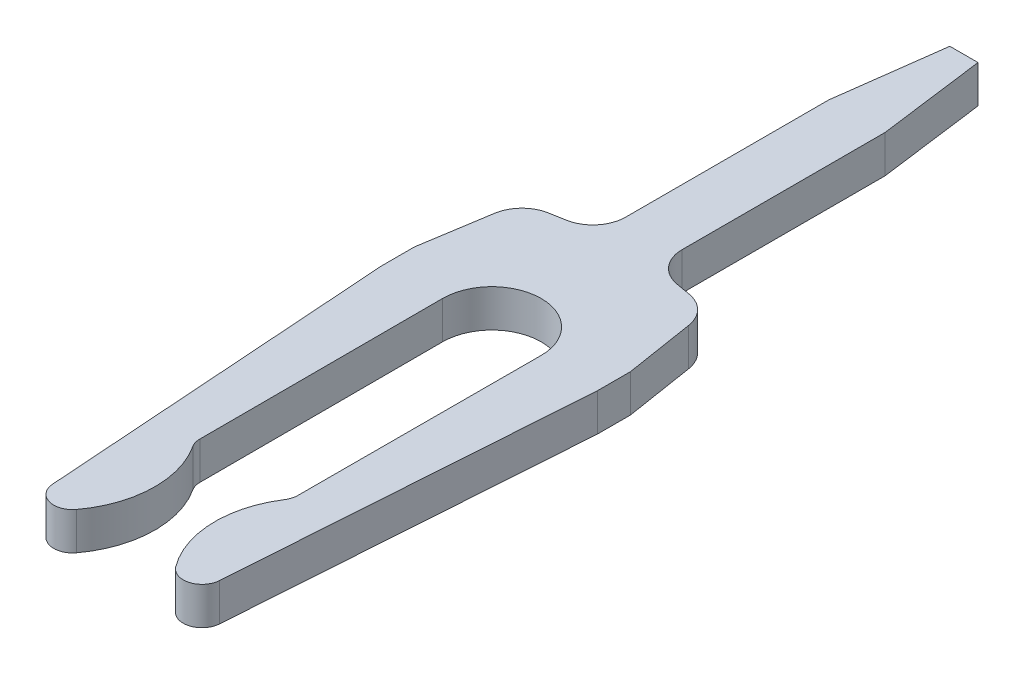
ISO-10303-21;
HEADER;
FILE_DESCRIPTION(('STEP AP214'),'2;1');
FILE_NAME('part.step','',(''),(''),'','','');
FILE_SCHEMA(('AUTOMOTIVE_DESIGN { 1 0 10303 214 1 1 1 1 }'));
ENDSEC;
DATA;
#1=APPLICATION_CONTEXT('core data for automotive mechanical design processes');
#2=APPLICATION_PROTOCOL_DEFINITION('international standard','automotive_design',2000,#1);
#3=PRODUCT_CONTEXT('',#1,'mechanical');
#4=PRODUCT('Part','Part','',(#3));
#5=PRODUCT_RELATED_PRODUCT_CATEGORY('part','',(#4));
#6=PRODUCT_DEFINITION_FORMATION('','',#4);
#7=PRODUCT_DEFINITION_CONTEXT('part definition',#1,'design');
#8=PRODUCT_DEFINITION('design','',#6,#7);
#9=PRODUCT_DEFINITION_SHAPE('','',#8);
#10=(LENGTH_UNIT() NAMED_UNIT(*) SI_UNIT(.MILLI.,.METRE.));
#11=(NAMED_UNIT(*) PLANE_ANGLE_UNIT() SI_UNIT($,.RADIAN.));
#12=(NAMED_UNIT(*) SI_UNIT($,.STERADIAN.) SOLID_ANGLE_UNIT());
#13=UNCERTAINTY_MEASURE_WITH_UNIT(LENGTH_MEASURE(1.E-05),#10,'distance_accuracy_value','');
#14=(GEOMETRIC_REPRESENTATION_CONTEXT(3) GLOBAL_UNCERTAINTY_ASSIGNED_CONTEXT((#13)) GLOBAL_UNIT_ASSIGNED_CONTEXT((#10,
#11,#12)) REPRESENTATION_CONTEXT('',''));
#15=CARTESIAN_POINT('',(0.,0.,0.));
#16=DIRECTION('',(0.,0.,1.));
#17=DIRECTION('',(1.,0.,0.));
#18=AXIS2_PLACEMENT_3D('',#15,#16,#17);
#19=CARTESIAN_POINT('',(0.,-0.2,0.));
#20=DIRECTION('',(0.,1.,0.));
#21=DIRECTION('',(1.,0.,0.));
#22=AXIS2_PLACEMENT_3D('',#19,#20,#21);
#23=PLANE('',#22);
#24=CARTESIAN_POINT('',(0.689021038746,-0.2,5.8));
#25=DIRECTION('',(0.,1.,0.));
#26=DIRECTION('',(-0.80115171912508,0.,0.59846129611106));
#27=AXIS2_PLACEMENT_3D('',#24,#25,#26);
#28=CIRCLE('',#27,0.2);
#29=CARTESIAN_POINT('',(0.52879069492,-0.2,5.919692259222));
#30=VERTEX_POINT('',#29);
#31=CARTESIAN_POINT('',(0.888540227534,-0.2,5.813859772906));
#32=VERTEX_POINT('',#31);
#33=EDGE_CURVE('E25',#30,#32,#28,.T.);
#34=ORIENTED_EDGE('',*,*,#33,.F.);
#35=CARTESIAN_POINT('',(1.37,-0.2,5.291307898307));
#36=DIRECTION('',(0.,1.,0.));
#37=DIRECTION('',(-0.839240132274354,0.,-0.54376097725023));
#38=AXIS2_PLACEMENT_3D('',#35,#36,#37);
#39=CIRCLE('',#38,1.05);
#40=CARTESIAN_POINT('',(0.488797861112,-0.2,4.720358872194));
#41=VERTEX_POINT('',#40);
#42=EDGE_CURVE('E532',#41,#30,#39,.T.);
#43=ORIENTED_EDGE('',*,*,#42,.F.);
#44=CARTESIAN_POINT('',(0.32094983466,-0.2,4.611606676746));
#45=DIRECTION('',(0.,-1.,0.));
#46=DIRECTION('',(0.999998773861923,0.,0.00156597402594488));
#47=AXIS2_PLACEMENT_3D('',#44,#45,#46);
#48=CIRCLE('',#47,0.2);
#49=CARTESIAN_POINT('',(0.520949589432,-0.2,4.611919871551));
#50=VERTEX_POINT('',#49);
#51=EDGE_CURVE('E399',#50,#41,#48,.T.);
#52=ORIENTED_EDGE('',*,*,#51,.F.);
#53=DIRECTION('',(-0.00156597402468689,0.,0.999998773861925));
#54=VECTOR('',#53,1.);
#55=CARTESIAN_POINT('',(0.524999356276,-0.2,2.025822136364));
#56=LINE('',#55,#54);
#57=CARTESIAN_POINT('',(0.524999356276,-0.2,2.025822136364));
#58=VERTEX_POINT('',#57);
#59=EDGE_CURVE('E411',#58,#50,#56,.T.);
#60=ORIENTED_EDGE('',*,*,#59,.F.);
#61=CARTESIAN_POINT('',(0.,-0.2,2.025));
#62=DIRECTION('',(0.,-1.,0.));
#63=DIRECTION('',(-0.999998773861923,0.,0.00156597402585288));
#64=AXIS2_PLACEMENT_3D('',#61,#62,#63);
#65=CIRCLE('',#64,0.525);
#66=CARTESIAN_POINT('',(-0.524999356278,-0.2,2.025822136364));
#67=VERTEX_POINT('',#66);
#68=EDGE_CURVE('E513',#67,#58,#65,.T.);
#69=ORIENTED_EDGE('',*,*,#68,.F.);
#70=DIRECTION('',(-0.00156597402468489,0.,-0.999998773861925));
#71=VECTOR('',#70,1.);
#72=CARTESIAN_POINT('',(-0.520949589432,-0.2,4.611919871551));
#73=LINE('',#72,#71);
#74=CARTESIAN_POINT('',(-0.520949589432,-0.2,4.611919871551));
#75=VERTEX_POINT('',#74);
#76=EDGE_CURVE('E501',#75,#67,#73,.T.);
#77=ORIENTED_EDGE('',*,*,#76,.F.);
#78=CARTESIAN_POINT('',(-0.32094983466,-0.2,4.611606676746));
#79=DIRECTION('',(0.,-1.,0.));
#80=DIRECTION('',(-0.839240132274354,0.,0.54376097725023));
#81=AXIS2_PLACEMENT_3D('',#78,#79,#80);
#82=CIRCLE('',#81,0.2);
#83=CARTESIAN_POINT('',(-0.488797861115,-0.2,4.720358872196));
#84=VERTEX_POINT('',#83);
#85=EDGE_CURVE('E340',#84,#75,#82,.T.);
#86=ORIENTED_EDGE('',*,*,#85,.F.);
#87=CARTESIAN_POINT('',(-1.37,-0.2,5.291307898307));
#88=DIRECTION('',(0.,1.,0.));
#89=DIRECTION('',(0.80115171912508,0.,0.59846129611106));
#90=AXIS2_PLACEMENT_3D('',#87,#88,#89);
#91=CIRCLE('',#90,1.05);
#92=CARTESIAN_POINT('',(-0.528790694919,-0.2,5.919692259224));
#93=VERTEX_POINT('',#92);
#94=EDGE_CURVE('E472',#93,#84,#91,.T.);
#95=ORIENTED_EDGE('',*,*,#94,.F.);
#96=CARTESIAN_POINT('',(-0.689021038746,-0.2,5.8));
#97=DIRECTION('',(0.,1.,0.));
#98=DIRECTION('',(-0.997595943944703,0.,0.0692988645294993));
#99=AXIS2_PLACEMENT_3D('',#96,#97,#98);
#100=CIRCLE('',#99,0.2);
#101=CARTESIAN_POINT('',(-0.888540227534,-0.2,5.813859772906));
#102=VERTEX_POINT('',#101);
#103=EDGE_CURVE('E480',#102,#93,#100,.T.);
#104=ORIENTED_EDGE('',*,*,#103,.F.);
#105=DIRECTION('',(0.0692988645311215,0.,0.99759594394459));
#106=VECTOR('',#105,1.);
#107=CARTESIAN_POINT('',(-1.15,-0.2,2.05));
#108=LINE('',#107,#106);
#109=CARTESIAN_POINT('',(-1.15,-0.2,2.05));
#110=VERTEX_POINT('',#109);
#111=EDGE_CURVE('E463',#110,#102,#108,.T.);
#112=ORIENTED_EDGE('',*,*,#111,.F.);
#113=DIRECTION('',(0.,0.,1.));
#114=VECTOR('',#113,1.);
#115=CARTESIAN_POINT('',(-1.15,-0.2,1.7));
#116=LINE('',#115,#114);
#117=CARTESIAN_POINT('',(-1.15,-0.2,1.7));
#118=VERTEX_POINT('',#117);
#119=EDGE_CURVE('E288',#118,#110,#116,.T.);
#120=ORIENTED_EDGE('',*,*,#119,.F.);
#121=DIRECTION('',(-0.156434465040027,0.,0.98768834059517));
#122=VECTOR('',#121,1.);
#123=CARTESIAN_POINT('',(-1.033217369735,-0.2,0.962663491274));
#124=LINE('',#123,#122);
#125=CARTESIAN_POINT('',(-1.033217369735,-0.2,0.962663491274));
#126=VERTEX_POINT('',#125);
#127=EDGE_CURVE('E304',#126,#118,#124,.T.);
#128=ORIENTED_EDGE('',*,*,#127,.F.);
#129=CARTESIAN_POINT('',(-0.687526450526,-0.2,1.017415554038));
#130=DIRECTION('',(0.,1.,0.));
#131=DIRECTION('',(-0.173648177667033,0.,-0.98480775301219));
#132=AXIS2_PLACEMENT_3D('',#129,#130,#131);
#133=CIRCLE('',#132,0.35);
#134=CARTESIAN_POINT('',(-0.74830331271,-0.2,0.672732840484));
#135=VERTEX_POINT('',#134);
#136=EDGE_CURVE('E327',#135,#126,#133,.T.);
#137=ORIENTED_EDGE('',*,*,#136,.F.);
#138=DIRECTION('',(-0.98480775301219,0.,0.173648177667033));
#139=VECTOR('',#138,1.);
#140=CARTESIAN_POINT('',(-0.589223137817,-0.2,0.644682713554));
#141=LINE('',#140,#139);
#142=CARTESIAN_POINT('',(-0.589223137817,-0.2,0.644682713554));
#143=VERTEX_POINT('',#142);
#144=EDGE_CURVE('E332',#143,#135,#141,.T.);
#145=ORIENTED_EDGE('',*,*,#144,.F.);
#146=CARTESIAN_POINT('',(-0.65,-0.2,0.3));
#147=DIRECTION('',(0.,-1.,0.));
#148=DIRECTION('',(1.,0.,0.));
#149=AXIS2_PLACEMENT_3D('',#146,#147,#148);
#150=CIRCLE('',#149,0.35);
#151=CARTESIAN_POINT('',(-0.3,-0.2,0.3));
#152=VERTEX_POINT('',#151);
#153=EDGE_CURVE('E420',#152,#143,#150,.T.);
#154=ORIENTED_EDGE('',*,*,#153,.F.);
#155=DIRECTION('',(0.,0.,1.));
#156=VECTOR('',#155,1.);
#157=CARTESIAN_POINT('',(-0.3,-0.2,-1.860636883091));
#158=LINE('',#157,#156);
#159=CARTESIAN_POINT('',(-0.3,-0.2,-1.860636883091));
#160=VERTEX_POINT('',#159);
#161=EDGE_CURVE('E297',#160,#152,#158,.T.);
#162=ORIENTED_EDGE('',*,*,#161,.F.);
#163=DIRECTION('',(-0.130526192219976,0.,0.99144486137382));
#164=VECTOR('',#163,1.);
#165=CARTESIAN_POINT('',(-0.15,-0.2,-3.));
#166=LINE('',#165,#164);
#167=CARTESIAN_POINT('',(-0.15,-0.2,-3.));
#168=VERTEX_POINT('',#167);
#169=EDGE_CURVE('E315',#168,#160,#166,.T.);
#170=ORIENTED_EDGE('',*,*,#169,.F.);
#171=DIRECTION('',(-1.,0.,0.));
#172=VECTOR('',#171,1.);
#173=CARTESIAN_POINT('',(0.15,-0.2,-3.));
#174=LINE('',#173,#172);
#175=CARTESIAN_POINT('',(0.15,-0.2,-3.));
#176=VERTEX_POINT('',#175);
#177=EDGE_CURVE('E384',#176,#168,#174,.T.);
#178=ORIENTED_EDGE('',*,*,#177,.F.);
#179=DIRECTION('',(-0.130526192219976,0.,-0.99144486137382));
#180=VECTOR('',#179,1.);
#181=CARTESIAN_POINT('',(0.3,-0.2,-1.860636883091));
#182=LINE('',#181,#180);
#183=CARTESIAN_POINT('',(0.3,-0.2,-1.860636883091));
#184=VERTEX_POINT('',#183);
#185=EDGE_CURVE('E371',#184,#176,#182,.T.);
#186=ORIENTED_EDGE('',*,*,#185,.F.);
#187=DIRECTION('',(0.,0.,-1.));
#188=VECTOR('',#187,1.);
#189=CARTESIAN_POINT('',(0.3,-0.2,0.3));
#190=LINE('',#189,#188);
#191=CARTESIAN_POINT('',(0.3,-0.2,0.3));
#192=VERTEX_POINT('',#191);
#193=EDGE_CURVE('E357',#192,#184,#190,.T.);
#194=ORIENTED_EDGE('',*,*,#193,.F.);
#195=CARTESIAN_POINT('',(0.65,-0.2,0.3));
#196=DIRECTION('',(0.,-1.,0.));
#197=DIRECTION('',(-0.173648177667033,0.,0.98480775301219));
#198=AXIS2_PLACEMENT_3D('',#195,#196,#197);
#199=CIRCLE('',#198,0.35);
#200=CARTESIAN_POINT('',(0.589223137817,-0.2,0.644682713554));
#201=VERTEX_POINT('',#200);
#202=EDGE_CURVE('E321',#201,#192,#199,.T.);
#203=ORIENTED_EDGE('',*,*,#202,.F.);
#204=DIRECTION('',(-0.98480775301219,0.,-0.173648177667033));
#205=VECTOR('',#204,1.);
#206=CARTESIAN_POINT('',(0.74830331271,-0.2,0.672732840484));
#207=LINE('',#206,#205);
#208=CARTESIAN_POINT('',(0.74830331271,-0.2,0.672732840484));
#209=VERTEX_POINT('',#208);
#210=EDGE_CURVE('E292',#209,#201,#207,.T.);
#211=ORIENTED_EDGE('',*,*,#210,.F.);
#212=CARTESIAN_POINT('',(0.687526450526,-0.2,1.017415554038));
#213=DIRECTION('',(0.,1.,0.));
#214=DIRECTION('',(0.98768834059517,0.,-0.156434465040027));
#215=AXIS2_PLACEMENT_3D('',#212,#213,#214);
#216=CIRCLE('',#215,0.35);
#217=CARTESIAN_POINT('',(1.033217369735,-0.2,0.962663491274));
#218=VERTEX_POINT('',#217);
#219=EDGE_CURVE('E258',#218,#209,#216,.T.);
#220=ORIENTED_EDGE('',*,*,#219,.F.);
#221=DIRECTION('',(-0.156434465040027,0.,-0.98768834059517));
#222=VECTOR('',#221,1.);
#223=CARTESIAN_POINT('',(1.15,-0.2,1.7));
#224=LINE('',#223,#222);
#225=CARTESIAN_POINT('',(1.15,-0.2,1.7));
#226=VERTEX_POINT('',#225);
#227=EDGE_CURVE('E269',#226,#218,#224,.T.);
#228=ORIENTED_EDGE('',*,*,#227,.F.);
#229=DIRECTION('',(0.,0.,-1.));
#230=VECTOR('',#229,1.);
#231=CARTESIAN_POINT('',(1.15,-0.2,2.05));
#232=LINE('',#231,#230);
#233=CARTESIAN_POINT('',(1.15,-0.2,2.05));
#234=VERTEX_POINT('',#233);
#235=EDGE_CURVE('E272',#234,#226,#232,.T.);
#236=ORIENTED_EDGE('',*,*,#235,.F.);
#237=DIRECTION('',(0.0692988645311215,0.,-0.99759594394459));
#238=VECTOR('',#237,1.);
#239=CARTESIAN_POINT('',(0.888540227534,-0.2,5.813859772906));
#240=LINE('',#239,#238);
#241=EDGE_CURVE('E550',#32,#234,#240,.T.);
#242=ORIENTED_EDGE('',*,*,#241,.F.);
#243=EDGE_LOOP('',(#34,#43,#52,#60,#69,#77,#86,#95,#104,#112,#120,#128,#137,#145,#154,#162,#170,
#178,#186,#194,#203,#211,#220,#228,#236,#242));
#244=FACE_BOUND('',#243,.T.);
#245=ADVANCED_FACE('F17',(#244),#23,.F.);
#246=CARTESIAN_POINT('',(0.,0.2,0.));
#247=DIRECTION('',(0.,1.,0.));
#248=DIRECTION('',(1.,0.,0.));
#249=AXIS2_PLACEMENT_3D('',#246,#247,#248);
#250=PLANE('',#249);
#251=DIRECTION('',(0.0692988645311215,0.,-0.99759594394459));
#252=VECTOR('',#251,1.);
#253=CARTESIAN_POINT('',(0.888540227534,0.2,5.813859772906));
#254=LINE('',#253,#252);
#255=CARTESIAN_POINT('',(0.888540227534,0.2,5.813859772906));
#256=VERTEX_POINT('',#255);
#257=CARTESIAN_POINT('',(1.15,0.2,2.05));
#258=VERTEX_POINT('',#257);
#259=EDGE_CURVE('E264',#256,#258,#254,.T.);
#260=ORIENTED_EDGE('',*,*,#259,.T.);
#261=DIRECTION('',(0.,0.,-1.));
#262=VECTOR('',#261,1.);
#263=CARTESIAN_POINT('',(1.15,0.2,2.05));
#264=LINE('',#263,#262);
#265=CARTESIAN_POINT('',(1.15,0.2,1.7));
#266=VERTEX_POINT('',#265);
#267=EDGE_CURVE('E261',#258,#266,#264,.T.);
#268=ORIENTED_EDGE('',*,*,#267,.T.);
#269=DIRECTION('',(-0.156434465040027,0.,-0.98768834059517));
#270=VECTOR('',#269,1.);
#271=CARTESIAN_POINT('',(1.15,0.2,1.7));
#272=LINE('',#271,#270);
#273=CARTESIAN_POINT('',(1.033217369735,0.2,0.962663491274));
#274=VERTEX_POINT('',#273);
#275=EDGE_CURVE('E246',#266,#274,#272,.T.);
#276=ORIENTED_EDGE('',*,*,#275,.T.);
#277=CARTESIAN_POINT('',(0.687526450526,0.2,1.017415554038));
#278=DIRECTION('',(0.,1.,0.));
#279=DIRECTION('',(0.98768834059517,0.,-0.156434465040027));
#280=AXIS2_PLACEMENT_3D('',#277,#278,#279);
#281=CIRCLE('',#280,0.35);
#282=CARTESIAN_POINT('',(0.74830331271,0.2,0.672732840484));
#283=VERTEX_POINT('',#282);
#284=EDGE_CURVE('E289',#274,#283,#281,.T.);
#285=ORIENTED_EDGE('',*,*,#284,.T.);
#286=DIRECTION('',(-0.98480775301219,0.,-0.173648177667033));
#287=VECTOR('',#286,1.);
#288=CARTESIAN_POINT('',(0.74830331271,0.2,0.672732840484));
#289=LINE('',#288,#287);
#290=CARTESIAN_POINT('',(0.589223137817,0.2,0.644682713554));
#291=VERTEX_POINT('',#290);
#292=EDGE_CURVE('E317',#283,#291,#289,.T.);
#293=ORIENTED_EDGE('',*,*,#292,.T.);
#294=CARTESIAN_POINT('',(0.65,0.2,0.3));
#295=DIRECTION('',(0.,-1.,0.));
#296=DIRECTION('',(-0.173648177667033,0.,0.98480775301219));
#297=AXIS2_PLACEMENT_3D('',#294,#295,#296);
#298=CIRCLE('',#297,0.35);
#299=CARTESIAN_POINT('',(0.3,0.2,0.3));
#300=VERTEX_POINT('',#299);
#301=EDGE_CURVE('E353',#291,#300,#298,.T.);
#302=ORIENTED_EDGE('',*,*,#301,.T.);
#303=DIRECTION('',(0.,0.,-1.));
#304=VECTOR('',#303,1.);
#305=CARTESIAN_POINT('',(0.3,0.2,0.3));
#306=LINE('',#305,#304);
#307=CARTESIAN_POINT('',(0.3,0.2,-1.860636883091));
#308=VERTEX_POINT('',#307);
#309=EDGE_CURVE('E365',#300,#308,#306,.T.);
#310=ORIENTED_EDGE('',*,*,#309,.T.);
#311=DIRECTION('',(-0.130526192219976,0.,-0.99144486137382));
#312=VECTOR('',#311,1.);
#313=CARTESIAN_POINT('',(0.3,0.2,-1.860636883091));
#314=LINE('',#313,#312);
#315=CARTESIAN_POINT('',(0.15,0.2,-3.));
#316=VERTEX_POINT('',#315);
#317=EDGE_CURVE('E370',#308,#316,#314,.T.);
#318=ORIENTED_EDGE('',*,*,#317,.T.);
#319=DIRECTION('',(-1.,0.,0.));
#320=VECTOR('',#319,1.);
#321=CARTESIAN_POINT('',(0.15,0.2,-3.));
#322=LINE('',#321,#320);
#323=CARTESIAN_POINT('',(-0.15,0.2,-3.));
#324=VERTEX_POINT('',#323);
#325=EDGE_CURVE('E311',#316,#324,#322,.T.);
#326=ORIENTED_EDGE('',*,*,#325,.T.);
#327=DIRECTION('',(-0.130526192219976,0.,0.99144486137382));
#328=VECTOR('',#327,1.);
#329=CARTESIAN_POINT('',(-0.15,0.2,-3.));
#330=LINE('',#329,#328);
#331=CARTESIAN_POINT('',(-0.3,0.2,-1.860636883091));
#332=VERTEX_POINT('',#331);
#333=EDGE_CURVE('E294',#324,#332,#330,.T.);
#334=ORIENTED_EDGE('',*,*,#333,.T.);
#335=DIRECTION('',(0.,0.,1.));
#336=VECTOR('',#335,1.);
#337=CARTESIAN_POINT('',(-0.3,0.2,-1.860636883091));
#338=LINE('',#337,#336);
#339=CARTESIAN_POINT('',(-0.3,0.2,0.3));
#340=VERTEX_POINT('',#339);
#341=EDGE_CURVE('E416',#332,#340,#338,.T.);
#342=ORIENTED_EDGE('',*,*,#341,.T.);
#343=CARTESIAN_POINT('',(-0.65,0.2,0.3));
#344=DIRECTION('',(0.,-1.,0.));
#345=DIRECTION('',(1.,0.,0.));
#346=AXIS2_PLACEMENT_3D('',#343,#344,#345);
#347=CIRCLE('',#346,0.35);
#348=CARTESIAN_POINT('',(-0.589223137817,0.2,0.644682713554));
#349=VERTEX_POINT('',#348);
#350=EDGE_CURVE('E336',#340,#349,#347,.T.);
#351=ORIENTED_EDGE('',*,*,#350,.T.);
#352=DIRECTION('',(-0.98480775301219,0.,0.173648177667033));
#353=VECTOR('',#352,1.);
#354=CARTESIAN_POINT('',(-0.589223137817,0.2,0.644682713554));
#355=LINE('',#354,#353);
#356=CARTESIAN_POINT('',(-0.74830331271,0.2,0.672732840484));
#357=VERTEX_POINT('',#356);
#358=EDGE_CURVE('E323',#349,#357,#355,.T.);
#359=ORIENTED_EDGE('',*,*,#358,.T.);
#360=CARTESIAN_POINT('',(-0.687526450526,0.2,1.017415554038));
#361=DIRECTION('',(0.,1.,0.));
#362=DIRECTION('',(-0.173648177667033,0.,-0.98480775301219));
#363=AXIS2_PLACEMENT_3D('',#360,#361,#362);
#364=CIRCLE('',#363,0.35);
#365=CARTESIAN_POINT('',(-1.033217369735,0.2,0.962663491274));
#366=VERTEX_POINT('',#365);
#367=EDGE_CURVE('E300',#357,#366,#364,.T.);
#368=ORIENTED_EDGE('',*,*,#367,.T.);
#369=DIRECTION('',(-0.156434465040027,0.,0.98768834059517));
#370=VECTOR('',#369,1.);
#371=CARTESIAN_POINT('',(-1.033217369735,0.2,0.962663491274));
#372=LINE('',#371,#370);
#373=CARTESIAN_POINT('',(-1.15,0.2,1.7));
#374=VERTEX_POINT('',#373);
#375=EDGE_CURVE('E453',#366,#374,#372,.T.);
#376=ORIENTED_EDGE('',*,*,#375,.T.);
#377=DIRECTION('',(0.,0.,1.));
#378=VECTOR('',#377,1.);
#379=CARTESIAN_POINT('',(-1.15,0.2,1.7));
#380=LINE('',#379,#378);
#381=CARTESIAN_POINT('',(-1.15,0.2,2.05));
#382=VERTEX_POINT('',#381);
#383=EDGE_CURVE('E287',#374,#382,#380,.T.);
#384=ORIENTED_EDGE('',*,*,#383,.T.);
#385=DIRECTION('',(0.0692988645311215,0.,0.99759594394459));
#386=VECTOR('',#385,1.);
#387=CARTESIAN_POINT('',(-1.15,0.2,2.05));
#388=LINE('',#387,#386);
#389=CARTESIAN_POINT('',(-0.888540227534,0.2,5.813859772906));
#390=VERTEX_POINT('',#389);
#391=EDGE_CURVE('E476',#382,#390,#388,.T.);
#392=ORIENTED_EDGE('',*,*,#391,.T.);
#393=CARTESIAN_POINT('',(-0.689021038746,0.2,5.8));
#394=DIRECTION('',(0.,1.,0.));
#395=DIRECTION('',(-0.997595943944703,0.,0.0692988645294993));
#396=AXIS2_PLACEMENT_3D('',#393,#394,#395);
#397=CIRCLE('',#396,0.2);
#398=CARTESIAN_POINT('',(-0.528790694919,0.2,5.919692259224));
#399=VERTEX_POINT('',#398);
#400=EDGE_CURVE('E488',#390,#399,#397,.T.);
#401=ORIENTED_EDGE('',*,*,#400,.T.);
#402=CARTESIAN_POINT('',(-1.37,0.2,5.291307898307));
#403=DIRECTION('',(0.,1.,0.));
#404=DIRECTION('',(0.80115171912508,0.,0.59846129611106));
#405=AXIS2_PLACEMENT_3D('',#402,#403,#404);
#406=CIRCLE('',#405,1.05);
#407=CARTESIAN_POINT('',(-0.488797861115,0.2,4.720358872196));
#408=VERTEX_POINT('',#407);
#409=EDGE_CURVE('E345',#399,#408,#406,.T.);
#410=ORIENTED_EDGE('',*,*,#409,.T.);
#411=CARTESIAN_POINT('',(-0.32094983466,0.2,4.611606676746));
#412=DIRECTION('',(0.,-1.,0.));
#413=DIRECTION('',(-0.839240132274354,0.,0.54376097725023));
#414=AXIS2_PLACEMENT_3D('',#411,#412,#413);
#415=CIRCLE('',#414,0.2);
#416=CARTESIAN_POINT('',(-0.520949589432,0.2,4.611919871551));
#417=VERTEX_POINT('',#416);
#418=EDGE_CURVE('E428',#408,#417,#415,.T.);
#419=ORIENTED_EDGE('',*,*,#418,.T.);
#420=DIRECTION('',(-0.00156597402468489,0.,-0.999998773861925));
#421=VECTOR('',#420,1.);
#422=CARTESIAN_POINT('',(-0.520949589432,0.2,4.611919871551));
#423=LINE('',#422,#421);
#424=CARTESIAN_POINT('',(-0.524999356278,0.2,2.025822136364));
#425=VERTEX_POINT('',#424);
#426=EDGE_CURVE('E509',#417,#425,#423,.T.);
#427=ORIENTED_EDGE('',*,*,#426,.T.);
#428=CARTESIAN_POINT('',(0.,0.2,2.025));
#429=DIRECTION('',(0.,-1.,0.));
#430=DIRECTION('',(-0.999998773861923,0.,0.00156597402585288));
#431=AXIS2_PLACEMENT_3D('',#428,#429,#430);
#432=CIRCLE('',#431,0.525);
#433=CARTESIAN_POINT('',(0.524999356276,0.2,2.025822136364));
#434=VERTEX_POINT('',#433);
#435=EDGE_CURVE('E407',#425,#434,#432,.T.);
#436=ORIENTED_EDGE('',*,*,#435,.T.);
#437=DIRECTION('',(-0.00156597402468689,0.,0.999998773861925));
#438=VECTOR('',#437,1.);
#439=CARTESIAN_POINT('',(0.524999356276,0.2,2.025822136364));
#440=LINE('',#439,#438);
#441=CARTESIAN_POINT('',(0.520949589432,0.2,4.611919871551));
#442=VERTEX_POINT('',#441);
#443=EDGE_CURVE('E438',#434,#442,#440,.T.);
#444=ORIENTED_EDGE('',*,*,#443,.T.);
#445=CARTESIAN_POINT('',(0.32094983466,0.2,4.611606676746));
#446=DIRECTION('',(0.,-1.,0.));
#447=DIRECTION('',(0.999998773861923,0.,0.00156597402594488));
#448=AXIS2_PLACEMENT_3D('',#445,#446,#447);
#449=CIRCLE('',#448,0.2);
#450=CARTESIAN_POINT('',(0.488797861112,0.2,4.720358872194));
#451=VERTEX_POINT('',#450);
#452=EDGE_CURVE('E398',#442,#451,#449,.T.);
#453=ORIENTED_EDGE('',*,*,#452,.T.);
#454=CARTESIAN_POINT('',(1.37,0.2,5.291307898307));
#455=DIRECTION('',(0.,1.,0.));
#456=DIRECTION('',(-0.839240132274354,0.,-0.54376097725023));
#457=AXIS2_PLACEMENT_3D('',#454,#455,#456);
#458=CIRCLE('',#457,1.05);
#459=CARTESIAN_POINT('',(0.52879069492,0.2,5.919692259222));
#460=VERTEX_POINT('',#459);
#461=EDGE_CURVE('E540',#451,#460,#458,.T.);
#462=ORIENTED_EDGE('',*,*,#461,.T.);
#463=CARTESIAN_POINT('',(0.689021038746,0.2,5.8));
#464=DIRECTION('',(0.,1.,0.));
#465=DIRECTION('',(-0.80115171912508,0.,0.59846129611106));
#466=AXIS2_PLACEMENT_3D('',#463,#464,#465);
#467=CIRCLE('',#466,0.2);
#468=EDGE_CURVE('E11',#460,#256,#467,.T.);
#469=ORIENTED_EDGE('',*,*,#468,.T.);
#470=EDGE_LOOP('',(#260,#268,#276,#285,#293,#302,#310,#318,#326,#334,#342,#351,#359,#368,#376,
#384,#392,#401,#410,#419,#427,#436,#444,#453,#462,#469));
#471=FACE_BOUND('',#470,.T.);
#472=ADVANCED_FACE('F262',(#471),#250,.T.);
#473=CARTESIAN_POINT('',(0.689021038746,-0.2,5.8));
#474=DIRECTION('',(0.,1.,0.));
#475=DIRECTION('',(-0.80115171912508,0.,0.59846129611106));
#476=AXIS2_PLACEMENT_3D('',#473,#474,#475);
#477=CYLINDRICAL_SURFACE('',#476,0.2);
#478=ORIENTED_EDGE('',*,*,#33,.T.);
#479=DIRECTION('',(0.,1.,0.));
#480=VECTOR('',#479,1.);
#481=CARTESIAN_POINT('',(0.888540227534,-0.2,5.813859772906));
#482=LINE('',#481,#480);
#483=EDGE_CURVE('E279',#32,#256,#482,.T.);
#484=ORIENTED_EDGE('',*,*,#483,.T.);
#485=ORIENTED_EDGE('',*,*,#468,.F.);
#486=DIRECTION('',(0.,1.,0.));
#487=VECTOR('',#486,1.);
#488=CARTESIAN_POINT('',(0.528790694919,-0.2,5.919692259224));
#489=LINE('',#488,#487);
#490=EDGE_CURVE('E536',#30,#460,#489,.T.);
#491=ORIENTED_EDGE('',*,*,#490,.F.);
#492=EDGE_LOOP('',(#478,#484,#485,#491));
#493=FACE_BOUND('',#492,.T.);
#494=ADVANCED_FACE('F546',(#493),#477,.T.);
#495=CARTESIAN_POINT('',(1.37,-0.2,5.291307898307));
#496=DIRECTION('',(0.,1.,0.));
#497=DIRECTION('',(-0.839240132274354,0.,-0.54376097725023));
#498=AXIS2_PLACEMENT_3D('',#495,#496,#497);
#499=CYLINDRICAL_SURFACE('',#498,1.05);
#500=ORIENTED_EDGE('',*,*,#42,.T.);
#501=ORIENTED_EDGE('',*,*,#490,.T.);
#502=ORIENTED_EDGE('',*,*,#461,.F.);
#503=DIRECTION('',(0.,1.,0.));
#504=VECTOR('',#503,1.);
#505=CARTESIAN_POINT('',(0.488797861115,-0.2,4.720358872196));
#506=LINE('',#505,#504);
#507=EDGE_CURVE('E394',#41,#451,#506,.T.);
#508=ORIENTED_EDGE('',*,*,#507,.F.);
#509=EDGE_LOOP('',(#500,#501,#502,#508));
#510=FACE_BOUND('',#509,.T.);
#511=ADVANCED_FACE('F986',(#510),#499,.T.);
#512=CARTESIAN_POINT('',(0.32094983466,-0.2,4.611606676746));
#513=DIRECTION('',(0.,-1.,0.));
#514=DIRECTION('',(0.999998773861923,0.,0.00156597402594988));
#515=AXIS2_PLACEMENT_3D('',#512,#513,#514);
#516=CYLINDRICAL_SURFACE('',#515,0.2);
#517=ORIENTED_EDGE('',*,*,#51,.T.);
#518=ORIENTED_EDGE('',*,*,#507,.T.);
#519=ORIENTED_EDGE('',*,*,#452,.F.);
#520=DIRECTION('',(0.,1.,0.));
#521=VECTOR('',#520,1.);
#522=CARTESIAN_POINT('',(0.520949589432,-0.2,4.611919871551));
#523=LINE('',#522,#521);
#524=EDGE_CURVE('E442',#50,#442,#523,.T.);
#525=ORIENTED_EDGE('',*,*,#524,.F.);
#526=EDGE_LOOP('',(#517,#518,#519,#525));
#527=FACE_BOUND('',#526,.T.);
#528=ADVANCED_FACE('F785',(#527),#516,.F.);
#529=CARTESIAN_POINT('',(0.524999356276,-0.2,2.025822136364));
#530=DIRECTION('',(-0.999998773861925,0.,-0.00156597402468689));
#531=DIRECTION('',(-0.00156597402468689,0.,0.999998773861925));
#532=AXIS2_PLACEMENT_3D('',#529,#530,#531);
#533=PLANE('',#532);
#534=ORIENTED_EDGE('',*,*,#59,.T.);
#535=ORIENTED_EDGE('',*,*,#524,.T.);
#536=ORIENTED_EDGE('',*,*,#443,.F.);
#537=DIRECTION('',(0.,1.,0.));
#538=VECTOR('',#537,1.);
#539=CARTESIAN_POINT('',(0.524999356276,-0.2,2.025822136364));
#540=LINE('',#539,#538);
#541=EDGE_CURVE('E412',#58,#434,#540,.T.);
#542=ORIENTED_EDGE('',*,*,#541,.F.);
#543=EDGE_LOOP('',(#534,#535,#536,#542));
#544=FACE_BOUND('',#543,.T.);
#545=ADVANCED_FACE('F779',(#544),#533,.T.);
#546=CARTESIAN_POINT('',(0.,-0.2,2.025));
#547=DIRECTION('',(0.,-1.,0.));
#548=DIRECTION('',(-0.999998773861923,0.,0.00156597402585288));
#549=AXIS2_PLACEMENT_3D('',#546,#547,#548);
#550=CYLINDRICAL_SURFACE('',#549,0.525);
#551=ORIENTED_EDGE('',*,*,#68,.T.);
#552=ORIENTED_EDGE('',*,*,#541,.T.);
#553=ORIENTED_EDGE('',*,*,#435,.F.);
#554=DIRECTION('',(0.,1.,0.));
#555=VECTOR('',#554,1.);
#556=CARTESIAN_POINT('',(-0.524999356276,-0.2,2.025822136364));
#557=LINE('',#556,#555);
#558=EDGE_CURVE('E505',#67,#425,#557,.T.);
#559=ORIENTED_EDGE('',*,*,#558,.F.);
#560=EDGE_LOOP('',(#551,#552,#553,#559));
#561=FACE_BOUND('',#560,.T.);
#562=ADVANCED_FACE('F784',(#561),#550,.F.);
#563=CARTESIAN_POINT('',(-0.520949589432,-0.2,4.611919871551));
#564=DIRECTION('',(0.999998773861925,0.,-0.00156597402468489));
#565=DIRECTION('',(0.,-1.,0.));
#566=AXIS2_PLACEMENT_3D('',#563,#564,#565);
#567=PLANE('',#566);
#568=ORIENTED_EDGE('',*,*,#76,.T.);
#569=ORIENTED_EDGE('',*,*,#558,.T.);
#570=ORIENTED_EDGE('',*,*,#426,.F.);
#571=DIRECTION('',(0.,1.,0.));
#572=VECTOR('',#571,1.);
#573=CARTESIAN_POINT('',(-0.520949589432,-0.2,4.611919871551));
#574=LINE('',#573,#572);
#575=EDGE_CURVE('E344',#75,#417,#574,.T.);
#576=ORIENTED_EDGE('',*,*,#575,.F.);
#577=EDGE_LOOP('',(#568,#569,#570,#576));
#578=FACE_BOUND('',#577,.T.);
#579=ADVANCED_FACE('F970',(#578),#567,.T.);
#580=CARTESIAN_POINT('',(-0.32094983466,-0.2,4.611606676746));
#581=DIRECTION('',(0.,-1.,0.));
#582=DIRECTION('',(-0.839240132274354,0.,0.54376097725023));
#583=AXIS2_PLACEMENT_3D('',#580,#581,#582);
#584=CYLINDRICAL_SURFACE('',#583,0.2);
#585=ORIENTED_EDGE('',*,*,#85,.T.);
#586=ORIENTED_EDGE('',*,*,#575,.T.);
#587=ORIENTED_EDGE('',*,*,#418,.F.);
#588=DIRECTION('',(0.,1.,0.));
#589=VECTOR('',#588,1.);
#590=CARTESIAN_POINT('',(-0.488797861112,-0.2,4.720358872194));
#591=LINE('',#590,#589);
#592=EDGE_CURVE('E468',#84,#408,#591,.T.);
#593=ORIENTED_EDGE('',*,*,#592,.F.);
#594=EDGE_LOOP('',(#585,#586,#587,#593));
#595=FACE_BOUND('',#594,.T.);
#596=ADVANCED_FACE('F961',(#595),#584,.F.);
#597=CARTESIAN_POINT('',(-1.37,-0.2,5.291307898307));
#598=DIRECTION('',(0.,1.,0.));
#599=DIRECTION('',(0.80115171912508,0.,0.59846129611106));
#600=AXIS2_PLACEMENT_3D('',#597,#598,#599);
#601=CYLINDRICAL_SURFACE('',#600,1.05);
#602=ORIENTED_EDGE('',*,*,#94,.T.);
#603=ORIENTED_EDGE('',*,*,#592,.T.);
#604=ORIENTED_EDGE('',*,*,#409,.F.);
#605=DIRECTION('',(0.,1.,0.));
#606=VECTOR('',#605,1.);
#607=CARTESIAN_POINT('',(-0.52879069492,-0.2,5.919692259222));
#608=LINE('',#607,#606);
#609=EDGE_CURVE('E484',#93,#399,#608,.T.);
#610=ORIENTED_EDGE('',*,*,#609,.F.);
#611=EDGE_LOOP('',(#602,#603,#604,#610));
#612=FACE_BOUND('',#611,.T.);
#613=ADVANCED_FACE('F952',(#612),#601,.T.);
#614=CARTESIAN_POINT('',(-0.689021038746,-0.2,5.8));
#615=DIRECTION('',(0.,1.,0.));
#616=DIRECTION('',(-0.997595943944703,0.,0.0692988645294993));
#617=AXIS2_PLACEMENT_3D('',#614,#615,#616);
#618=CYLINDRICAL_SURFACE('',#617,0.2);
#619=ORIENTED_EDGE('',*,*,#103,.T.);
#620=ORIENTED_EDGE('',*,*,#609,.T.);
#621=ORIENTED_EDGE('',*,*,#400,.F.);
#622=DIRECTION('',(0.,1.,0.));
#623=VECTOR('',#622,1.);
#624=CARTESIAN_POINT('',(-0.888540227534,-0.2,5.813859772906));
#625=LINE('',#624,#623);
#626=EDGE_CURVE('E467',#102,#390,#625,.T.);
#627=ORIENTED_EDGE('',*,*,#626,.F.);
#628=EDGE_LOOP('',(#619,#620,#621,#627));
#629=FACE_BOUND('',#628,.T.);
#630=ADVANCED_FACE('F915',(#629),#618,.T.);
#631=CARTESIAN_POINT('',(-1.15,-0.2,2.05));
#632=DIRECTION('',(-0.99759594394459,0.,0.0692988645311215));
#633=DIRECTION('',(0.,1.,0.));
#634=AXIS2_PLACEMENT_3D('',#631,#632,#633);
#635=PLANE('',#634);
#636=ORIENTED_EDGE('',*,*,#111,.T.);
#637=ORIENTED_EDGE('',*,*,#626,.T.);
#638=ORIENTED_EDGE('',*,*,#391,.F.);
#639=DIRECTION('',(0.,1.,0.));
#640=VECTOR('',#639,1.);
#641=CARTESIAN_POINT('',(-1.15,-0.2,2.05));
#642=LINE('',#641,#640);
#643=EDGE_CURVE('E283',#110,#382,#642,.T.);
#644=ORIENTED_EDGE('',*,*,#643,.F.);
#645=EDGE_LOOP('',(#636,#637,#638,#644));
#646=FACE_BOUND('',#645,.T.);
#647=ADVANCED_FACE('F910',(#646),#635,.T.);
#648=CARTESIAN_POINT('',(-1.15,-0.2,1.7));
#649=DIRECTION('',(-1.,0.,0.));
#650=DIRECTION('',(0.,0.,1.));
#651=AXIS2_PLACEMENT_3D('',#648,#649,#650);
#652=PLANE('',#651);
#653=ORIENTED_EDGE('',*,*,#119,.T.);
#654=ORIENTED_EDGE('',*,*,#643,.T.);
#655=ORIENTED_EDGE('',*,*,#383,.F.);
#656=DIRECTION('',(0.,1.,0.));
#657=VECTOR('',#656,1.);
#658=CARTESIAN_POINT('',(-1.15,-0.2,1.7));
#659=LINE('',#658,#657);
#660=EDGE_CURVE('E449',#118,#374,#659,.T.);
#661=ORIENTED_EDGE('',*,*,#660,.F.);
#662=EDGE_LOOP('',(#653,#654,#655,#661));
#663=FACE_BOUND('',#662,.T.);
#664=ADVANCED_FACE('F805',(#663),#652,.T.);
#665=CARTESIAN_POINT('',(-1.033217369735,-0.2,0.962663491274));
#666=DIRECTION('',(-0.98768834059517,0.,-0.156434465040027));
#667=DIRECTION('',(-0.156434465040027,0.,0.98768834059517));
#668=AXIS2_PLACEMENT_3D('',#665,#666,#667);
#669=PLANE('',#668);
#670=ORIENTED_EDGE('',*,*,#127,.T.);
#671=ORIENTED_EDGE('',*,*,#660,.T.);
#672=ORIENTED_EDGE('',*,*,#375,.F.);
#673=DIRECTION('',(0.,1.,0.));
#674=VECTOR('',#673,1.);
#675=CARTESIAN_POINT('',(-1.033217369735,-0.2,0.962663491274));
#676=LINE('',#675,#674);
#677=EDGE_CURVE('E305',#126,#366,#676,.T.);
#678=ORIENTED_EDGE('',*,*,#677,.F.);
#679=EDGE_LOOP('',(#670,#671,#672,#678));
#680=FACE_BOUND('',#679,.T.);
#681=ADVANCED_FACE('F799',(#680),#669,.T.);
#682=CARTESIAN_POINT('',(-0.687526450526,-0.2,1.017415554038));
#683=DIRECTION('',(0.,1.,0.));
#684=DIRECTION('',(-0.173648177667033,0.,-0.98480775301219));
#685=AXIS2_PLACEMENT_3D('',#682,#683,#684);
#686=CYLINDRICAL_SURFACE('',#685,0.35);
#687=ORIENTED_EDGE('',*,*,#136,.T.);
#688=ORIENTED_EDGE('',*,*,#677,.T.);
#689=ORIENTED_EDGE('',*,*,#367,.F.);
#690=DIRECTION('',(0.,1.,0.));
#691=VECTOR('',#690,1.);
#692=CARTESIAN_POINT('',(-0.74830331271,-0.2,0.672732840484));
#693=LINE('',#692,#691);
#694=EDGE_CURVE('E328',#135,#357,#693,.T.);
#695=ORIENTED_EDGE('',*,*,#694,.F.);
#696=EDGE_LOOP('',(#687,#688,#689,#695));
#697=FACE_BOUND('',#696,.T.);
#698=ADVANCED_FACE('F804',(#697),#686,.T.);
#699=CARTESIAN_POINT('',(-0.589223137817,-0.2,0.644682713554));
#700=DIRECTION('',(-0.173648177667033,0.,-0.98480775301219));
#701=DIRECTION('',(-0.98480775301219,0.,0.173648177667033));
#702=AXIS2_PLACEMENT_3D('',#699,#700,#701);
#703=PLANE('',#702);
#704=ORIENTED_EDGE('',*,*,#144,.T.);
#705=ORIENTED_EDGE('',*,*,#694,.T.);
#706=ORIENTED_EDGE('',*,*,#358,.F.);
#707=DIRECTION('',(0.,1.,0.));
#708=VECTOR('',#707,1.);
#709=CARTESIAN_POINT('',(-0.589223137817,-0.2,0.644682713554));
#710=LINE('',#709,#708);
#711=EDGE_CURVE('E424',#143,#349,#710,.T.);
#712=ORIENTED_EDGE('',*,*,#711,.F.);
#713=EDGE_LOOP('',(#704,#705,#706,#712));
#714=FACE_BOUND('',#713,.T.);
#715=ADVANCED_FACE('F821',(#714),#703,.T.);
#716=CARTESIAN_POINT('',(-0.65,-0.2,0.3));
#717=DIRECTION('',(0.,-1.,0.));
#718=DIRECTION('',(1.,0.,0.));
#719=AXIS2_PLACEMENT_3D('',#716,#717,#718);
#720=CYLINDRICAL_SURFACE('',#719,0.35);
#721=ORIENTED_EDGE('',*,*,#153,.T.);
#722=ORIENTED_EDGE('',*,*,#711,.T.);
#723=ORIENTED_EDGE('',*,*,#350,.F.);
#724=DIRECTION('',(0.,1.,0.));
#725=VECTOR('',#724,1.);
#726=CARTESIAN_POINT('',(-0.3,-0.2,0.3));
#727=LINE('',#726,#725);
#728=EDGE_CURVE('E406',#152,#340,#727,.T.);
#729=ORIENTED_EDGE('',*,*,#728,.F.);
#730=EDGE_LOOP('',(#721,#722,#723,#729));
#731=FACE_BOUND('',#730,.T.);
#732=ADVANCED_FACE('F826',(#731),#720,.F.);
#733=CARTESIAN_POINT('',(-0.3,-0.2,-1.860636883091));
#734=DIRECTION('',(-1.,0.,0.));
#735=DIRECTION('',(0.,0.,1.));
#736=AXIS2_PLACEMENT_3D('',#733,#734,#735);
#737=PLANE('',#736);
#738=ORIENTED_EDGE('',*,*,#161,.T.);
#739=ORIENTED_EDGE('',*,*,#728,.T.);
#740=ORIENTED_EDGE('',*,*,#341,.F.);
#741=DIRECTION('',(0.,1.,0.));
#742=VECTOR('',#741,1.);
#743=CARTESIAN_POINT('',(-0.3,-0.2,-1.860636883091));
#744=LINE('',#743,#742);
#745=EDGE_CURVE('E298',#160,#332,#744,.T.);
#746=ORIENTED_EDGE('',*,*,#745,.F.);
#747=EDGE_LOOP('',(#738,#739,#740,#746));
#748=FACE_BOUND('',#747,.T.);
#749=ADVANCED_FACE('F904',(#748),#737,.T.);
#750=CARTESIAN_POINT('',(-0.15,-0.2,-3.));
#751=DIRECTION('',(-0.99144486137382,0.,-0.130526192219976));
#752=DIRECTION('',(-0.130526192219976,0.,0.99144486137382));
#753=AXIS2_PLACEMENT_3D('',#750,#751,#752);
#754=PLANE('',#753);
#755=ORIENTED_EDGE('',*,*,#169,.T.);
#756=ORIENTED_EDGE('',*,*,#745,.T.);
#757=ORIENTED_EDGE('',*,*,#333,.F.);
#758=DIRECTION('',(0.,1.,0.));
#759=VECTOR('',#758,1.);
#760=CARTESIAN_POINT('',(-0.15,-0.2,-3.));
#761=LINE('',#760,#759);
#762=EDGE_CURVE('E316',#168,#324,#761,.T.);
#763=ORIENTED_EDGE('',*,*,#762,.F.);
#764=EDGE_LOOP('',(#755,#756,#757,#763));
#765=FACE_BOUND('',#764,.T.);
#766=ADVANCED_FACE('F871',(#765),#754,.T.);
#767=CARTESIAN_POINT('',(0.15,-0.2,-3.));
#768=DIRECTION('',(0.,0.,-1.));
#769=DIRECTION('',(0.,-1.,0.));
#770=AXIS2_PLACEMENT_3D('',#767,#768,#769);
#771=PLANE('',#770);
#772=ORIENTED_EDGE('',*,*,#177,.T.);
#773=ORIENTED_EDGE('',*,*,#762,.T.);
#774=ORIENTED_EDGE('',*,*,#325,.F.);
#775=DIRECTION('',(0.,1.,0.));
#776=VECTOR('',#775,1.);
#777=CARTESIAN_POINT('',(0.15,-0.2,-3.));
#778=LINE('',#777,#776);
#779=EDGE_CURVE('E366',#176,#316,#778,.T.);
#780=ORIENTED_EDGE('',*,*,#779,.F.);
#781=EDGE_LOOP('',(#772,#773,#774,#780));
#782=FACE_BOUND('',#781,.T.);
#783=ADVANCED_FACE('F865',(#782),#771,.T.);
#784=CARTESIAN_POINT('',(0.3,-0.2,-1.860636883091));
#785=DIRECTION('',(0.99144486137382,0.,-0.130526192219976));
#786=DIRECTION('',(0.,-1.,0.));
#787=AXIS2_PLACEMENT_3D('',#784,#785,#786);
#788=PLANE('',#787);
#789=ORIENTED_EDGE('',*,*,#185,.T.);
#790=ORIENTED_EDGE('',*,*,#779,.T.);
#791=ORIENTED_EDGE('',*,*,#317,.F.);
#792=DIRECTION('',(0.,1.,0.));
#793=VECTOR('',#792,1.);
#794=CARTESIAN_POINT('',(0.3,-0.2,-1.860636883091));
#795=LINE('',#794,#793);
#796=EDGE_CURVE('E361',#184,#308,#795,.T.);
#797=ORIENTED_EDGE('',*,*,#796,.F.);
#798=EDGE_LOOP('',(#789,#790,#791,#797));
#799=FACE_BOUND('',#798,.T.);
#800=ADVANCED_FACE('F870',(#799),#788,.T.);
#801=CARTESIAN_POINT('',(0.3,-0.2,0.3));
#802=DIRECTION('',(1.,0.,0.));
#803=DIRECTION('',(0.,1.,0.));
#804=AXIS2_PLACEMENT_3D('',#801,#802,#803);
#805=PLANE('',#804);
#806=ORIENTED_EDGE('',*,*,#193,.T.);
#807=ORIENTED_EDGE('',*,*,#796,.T.);
#808=ORIENTED_EDGE('',*,*,#309,.F.);
#809=DIRECTION('',(0.,1.,0.));
#810=VECTOR('',#809,1.);
#811=CARTESIAN_POINT('',(0.3,-0.2,0.3));
#812=LINE('',#811,#810);
#813=EDGE_CURVE('E349',#192,#300,#812,.T.);
#814=ORIENTED_EDGE('',*,*,#813,.F.);
#815=EDGE_LOOP('',(#806,#807,#808,#814));
#816=FACE_BOUND('',#815,.T.);
#817=ADVANCED_FACE('F881',(#816),#805,.T.);
#818=CARTESIAN_POINT('',(0.65,-0.2,0.3));
#819=DIRECTION('',(0.,-1.,0.));
#820=DIRECTION('',(-0.173648177667033,0.,0.98480775301219));
#821=AXIS2_PLACEMENT_3D('',#818,#819,#820);
#822=CYLINDRICAL_SURFACE('',#821,0.35);
#823=ORIENTED_EDGE('',*,*,#202,.T.);
#824=ORIENTED_EDGE('',*,*,#813,.T.);
#825=ORIENTED_EDGE('',*,*,#301,.F.);
#826=DIRECTION('',(0.,1.,0.));
#827=VECTOR('',#826,1.);
#828=CARTESIAN_POINT('',(0.589223137817,-0.2,0.644682713554));
#829=LINE('',#828,#827);
#830=EDGE_CURVE('E322',#201,#291,#829,.T.);
#831=ORIENTED_EDGE('',*,*,#830,.F.);
#832=EDGE_LOOP('',(#823,#824,#825,#831));
#833=FACE_BOUND('',#832,.T.);
#834=ADVANCED_FACE('F859',(#833),#822,.F.);
#835=CARTESIAN_POINT('',(0.74830331271,-0.2,0.672732840484));
#836=DIRECTION('',(0.173648177667033,0.,-0.98480775301219));
#837=DIRECTION('',(0.,-1.,0.));
#838=AXIS2_PLACEMENT_3D('',#835,#836,#837);
#839=PLANE('',#838);
#840=ORIENTED_EDGE('',*,*,#210,.T.);
#841=ORIENTED_EDGE('',*,*,#830,.T.);
#842=ORIENTED_EDGE('',*,*,#292,.F.);
#843=DIRECTION('',(0.,1.,0.));
#844=VECTOR('',#843,1.);
#845=CARTESIAN_POINT('',(0.74830331271,-0.2,0.672732840484));
#846=LINE('',#845,#844);
#847=EDGE_CURVE('E293',#209,#283,#846,.T.);
#848=ORIENTED_EDGE('',*,*,#847,.F.);
#849=EDGE_LOOP('',(#840,#841,#842,#848));
#850=FACE_BOUND('',#849,.T.);
#851=ADVANCED_FACE('F850',(#850),#839,.T.);
#852=CARTESIAN_POINT('',(0.687526450526,-0.2,1.017415554038));
#853=DIRECTION('',(0.,1.,0.));
#854=DIRECTION('',(0.98768834059517,0.,-0.156434465040027));
#855=AXIS2_PLACEMENT_3D('',#852,#853,#854);
#856=CYLINDRICAL_SURFACE('',#855,0.35);
#857=ORIENTED_EDGE('',*,*,#219,.T.);
#858=ORIENTED_EDGE('',*,*,#847,.T.);
#859=ORIENTED_EDGE('',*,*,#284,.F.);
#860=DIRECTION('',(0.,1.,0.));
#861=VECTOR('',#860,1.);
#862=CARTESIAN_POINT('',(1.033217369735,-0.2,0.962663491274));
#863=LINE('',#862,#861);
#864=EDGE_CURVE('E254',#218,#274,#863,.T.);
#865=ORIENTED_EDGE('',*,*,#864,.F.);
#866=EDGE_LOOP('',(#857,#858,#859,#865));
#867=FACE_BOUND('',#866,.T.);
#868=ADVANCED_FACE('F842',(#867),#856,.T.);
#869=CARTESIAN_POINT('',(1.15,-0.2,1.7));
#870=DIRECTION('',(0.98768834059517,0.,-0.156434465040027));
#871=DIRECTION('',(0.,-1.,0.));
#872=AXIS2_PLACEMENT_3D('',#869,#870,#871);
#873=PLANE('',#872);
#874=ORIENTED_EDGE('',*,*,#227,.T.);
#875=ORIENTED_EDGE('',*,*,#864,.T.);
#876=ORIENTED_EDGE('',*,*,#275,.F.);
#877=DIRECTION('',(0.,1.,0.));
#878=VECTOR('',#877,1.);
#879=CARTESIAN_POINT('',(1.15,-0.2,1.7));
#880=LINE('',#879,#878);
#881=EDGE_CURVE('E251',#226,#266,#880,.T.);
#882=ORIENTED_EDGE('',*,*,#881,.F.);
#883=EDGE_LOOP('',(#874,#875,#876,#882));
#884=FACE_BOUND('',#883,.T.);
#885=ADVANCED_FACE('F249',(#884),#873,.T.);
#886=CARTESIAN_POINT('',(1.15,-0.2,2.05));
#887=DIRECTION('',(1.,0.,0.));
#888=DIRECTION('',(0.,1.,0.));
#889=AXIS2_PLACEMENT_3D('',#886,#887,#888);
#890=PLANE('',#889);
#891=ORIENTED_EDGE('',*,*,#235,.T.);
#892=ORIENTED_EDGE('',*,*,#881,.T.);
#893=ORIENTED_EDGE('',*,*,#267,.F.);
#894=DIRECTION('',(0.,1.,0.));
#895=VECTOR('',#894,1.);
#896=CARTESIAN_POINT('',(1.15,-0.2,2.05));
#897=LINE('',#896,#895);
#898=EDGE_CURVE('E554',#234,#258,#897,.T.);
#899=ORIENTED_EDGE('',*,*,#898,.F.);
#900=EDGE_LOOP('',(#891,#892,#893,#899));
#901=FACE_BOUND('',#900,.T.);
#902=ADVANCED_FACE('F271',(#901),#890,.T.);
#903=CARTESIAN_POINT('',(0.888540227534,-0.2,5.813859772906));
#904=DIRECTION('',(0.99759594394459,0.,0.0692988645311215));
#905=DIRECTION('',(0.,-1.,0.));
#906=AXIS2_PLACEMENT_3D('',#903,#904,#905);
#907=PLANE('',#906);
#908=ORIENTED_EDGE('',*,*,#241,.T.);
#909=ORIENTED_EDGE('',*,*,#898,.T.);
#910=ORIENTED_EDGE('',*,*,#259,.F.);
#911=ORIENTED_EDGE('',*,*,#483,.F.);
#912=EDGE_LOOP('',(#908,#909,#910,#911));
#913=FACE_BOUND('',#912,.T.);
#914=ADVANCED_FACE('F549',(#913),#907,.T.);
#915=CLOSED_SHELL('',(#245,#472,#494,#511,#528,#545,#562,#579,#596,#613,#630,#647,#664,#681,
#698,#715,#732,#749,#766,#783,#800,#817,#834,#851,#868,#885,#902,#914));
#916=MANIFOLD_SOLID_BREP('B1',#915);
#917=ADVANCED_BREP_SHAPE_REPRESENTATION('',(#18,#916),#14);
#918=SHAPE_DEFINITION_REPRESENTATION(#9,#917);
ENDSEC;
END-ISO-10303-21;
